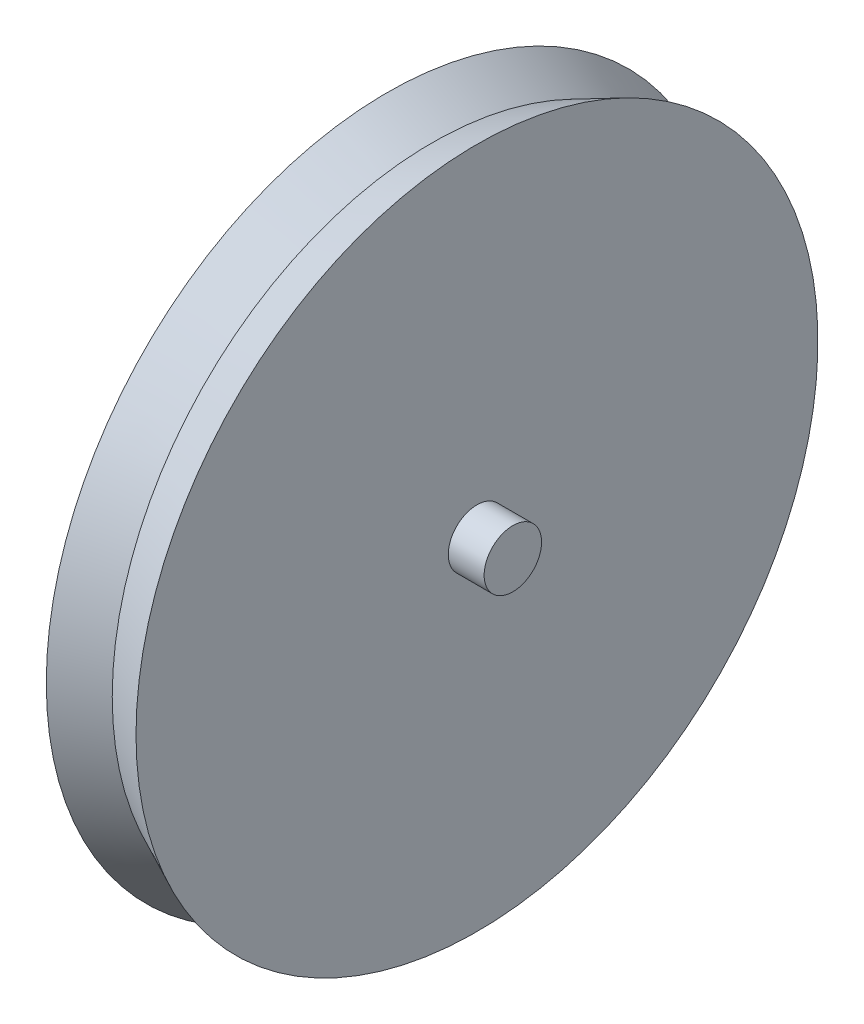
ISO-10303-21;
HEADER;
FILE_DESCRIPTION(('STEP AP214'),'2;1');
FILE_NAME('part.step','',(''),(''),'','','');
FILE_SCHEMA(('AUTOMOTIVE_DESIGN { 1 0 10303 214 1 1 1 1 }'));
ENDSEC;
DATA;
#1=APPLICATION_CONTEXT('core data for automotive mechanical design processes');
#2=APPLICATION_PROTOCOL_DEFINITION('international standard','automotive_design',2000,#1);
#3=PRODUCT_CONTEXT('',#1,'mechanical');
#4=PRODUCT('Part','Part','',(#3));
#5=PRODUCT_RELATED_PRODUCT_CATEGORY('part','',(#4));
#6=PRODUCT_DEFINITION_FORMATION('','',#4);
#7=PRODUCT_DEFINITION_CONTEXT('part definition',#1,'design');
#8=PRODUCT_DEFINITION('design','',#6,#7);
#9=PRODUCT_DEFINITION_SHAPE('','',#8);
#10=(LENGTH_UNIT() NAMED_UNIT(*) SI_UNIT(.MILLI.,.METRE.));
#11=(NAMED_UNIT(*) PLANE_ANGLE_UNIT() SI_UNIT($,.RADIAN.));
#12=(NAMED_UNIT(*) SI_UNIT($,.STERADIAN.) SOLID_ANGLE_UNIT());
#13=UNCERTAINTY_MEASURE_WITH_UNIT(LENGTH_MEASURE(1.E-05),#10,'distance_accuracy_value','');
#14=(GEOMETRIC_REPRESENTATION_CONTEXT(3) GLOBAL_UNCERTAINTY_ASSIGNED_CONTEXT((#13)) GLOBAL_UNIT_ASSIGNED_CONTEXT((#10,
#11,#12)) REPRESENTATION_CONTEXT('',''));
#15=CARTESIAN_POINT('',(0.,0.,0.));
#16=DIRECTION('',(0.,0.,1.));
#17=DIRECTION('',(1.,0.,0.));
#18=AXIS2_PLACEMENT_3D('',#15,#16,#17);
#19=CARTESIAN_POINT('',(0.,0.,0.));
#20=DIRECTION('',(1.,0.,0.));
#21=DIRECTION('',(0.,0.,-1.));
#22=AXIS2_PLACEMENT_3D('',#19,#20,#21);
#23=PLANE('',#22);
#24=CARTESIAN_POINT('',(0.,0.,0.));
#25=DIRECTION('',(1.,0.,0.));
#26=DIRECTION('',(0.,0.,-1.));
#27=AXIS2_PLACEMENT_3D('',#24,#25,#26);
#28=CIRCLE('',#27,1.27);
#29=CARTESIAN_POINT('',(0.,0.,-1.27));
#30=VERTEX_POINT('',#29);
#31=EDGE_CURVE('E51',#30,#30,#28,.T.);
#32=ORIENTED_EDGE('',*,*,#31,.T.);
#33=EDGE_LOOP('',(#32));
#34=FACE_BOUND('',#33,.T.);
#35=CARTESIAN_POINT('',(0.,0.,0.));
#36=DIRECTION('',(-1.,0.,0.));
#37=DIRECTION('',(0.,0.,1.));
#38=AXIS2_PLACEMENT_3D('',#35,#36,#37);
#39=CIRCLE('',#38,15.08125);
#40=CARTESIAN_POINT('',(0.,0.,15.08125));
#41=VERTEX_POINT('',#40);
#42=EDGE_CURVE('E46',#41,#41,#39,.T.);
#43=ORIENTED_EDGE('',*,*,#42,.T.);
#44=EDGE_LOOP('',(#43));
#45=FACE_BOUND('',#44,.T.);
#46=ADVANCED_FACE('F35',(#34,#45),#23,.F.);
#47=CARTESIAN_POINT('',(3.96875,0.,0.));
#48=DIRECTION('',(-1.,0.,0.));
#49=DIRECTION('',(0.,0.,1.));
#50=AXIS2_PLACEMENT_3D('',#47,#48,#49);
#51=PLANE('',#50);
#52=CARTESIAN_POINT('',(3.96875,0.,0.));
#53=DIRECTION('',(-1.,0.,0.));
#54=DIRECTION('',(0.,0.,1.));
#55=AXIS2_PLACEMENT_3D('',#52,#53,#54);
#56=CIRCLE('',#55,1.27);
#57=CARTESIAN_POINT('',(3.96875,0.,1.27));
#58=VERTEX_POINT('',#57);
#59=EDGE_CURVE('E38',#58,#58,#56,.T.);
#60=ORIENTED_EDGE('',*,*,#59,.T.);
#61=EDGE_LOOP('',(#60));
#62=FACE_BOUND('',#61,.T.);
#63=CARTESIAN_POINT('',(3.96875,0.,0.));
#64=DIRECTION('',(-1.,0.,0.));
#65=DIRECTION('',(0.,0.,1.));
#66=AXIS2_PLACEMENT_3D('',#63,#64,#65);
#67=CIRCLE('',#66,15.08125);
#68=CARTESIAN_POINT('',(3.96875,0.,15.08125));
#69=VERTEX_POINT('',#68);
#70=EDGE_CURVE('E10',#69,#69,#67,.T.);
#71=ORIENTED_EDGE('',*,*,#70,.F.);
#72=EDGE_LOOP('',(#71));
#73=FACE_BOUND('',#72,.T.);
#74=ADVANCED_FACE('F71',(#62,#73),#51,.F.);
#75=CARTESIAN_POINT('',(1.984375,0.,0.));
#76=DIRECTION('',(1.,0.,0.));
#77=DIRECTION('',(0.,0.,-1.));
#78=AXIS2_PLACEMENT_3D('',#75,#76,#77);
#79=CONICAL_SURFACE('',#78,14.1483885827314,0.439445568474056);
#80=ORIENTED_EDGE('',*,*,#70,.T.);
#81=EDGE_LOOP('',(#80));
#82=FACE_BOUND('',#81,.T.);
#83=CARTESIAN_POINT('',(1.984375,0.,0.));
#84=DIRECTION('',(-1.,0.,0.));
#85=DIRECTION('',(0.,0.,1.));
#86=AXIS2_PLACEMENT_3D('',#83,#84,#85);
#87=CIRCLE('',#86,14.1483885827314);
#88=CARTESIAN_POINT('',(1.984375,0.,14.1483885827314));
#89=VERTEX_POINT('',#88);
#90=EDGE_CURVE('E42',#89,#89,#87,.T.);
#91=ORIENTED_EDGE('',*,*,#90,.F.);
#92=EDGE_LOOP('',(#91));
#93=FACE_BOUND('',#92,.T.);
#94=ADVANCED_FACE('F74',(#82,#93),#79,.T.);
#95=CARTESIAN_POINT('',(0.,0.,0.));
#96=DIRECTION('',(-1.,0.,0.));
#97=DIRECTION('',(0.,0.,1.));
#98=AXIS2_PLACEMENT_3D('',#95,#96,#97);
#99=CONICAL_SURFACE('',#98,15.08125,0.439445568474056);
#100=ORIENTED_EDGE('',*,*,#90,.T.);
#101=EDGE_LOOP('',(#100));
#102=FACE_BOUND('',#101,.T.);
#103=ORIENTED_EDGE('',*,*,#42,.F.);
#104=EDGE_LOOP('',(#103));
#105=FACE_BOUND('',#104,.T.);
#106=ADVANCED_FACE('F79',(#102,#105),#99,.T.);
#107=CARTESIAN_POINT('',(5.55625,0.,0.));
#108=DIRECTION('',(1.,0.,0.));
#109=DIRECTION('',(0.,0.,-1.));
#110=AXIS2_PLACEMENT_3D('',#107,#108,#109);
#111=PLANE('',#110);
#112=CARTESIAN_POINT('',(5.55625,0.,0.));
#113=DIRECTION('',(1.,0.,0.));
#114=DIRECTION('',(0.,0.,-1.));
#115=AXIS2_PLACEMENT_3D('',#112,#113,#114);
#116=CIRCLE('',#115,1.27);
#117=CARTESIAN_POINT('',(5.55625,0.,-1.27));
#118=VERTEX_POINT('',#117);
#119=EDGE_CURVE('E57',#118,#118,#116,.T.);
#120=ORIENTED_EDGE('',*,*,#119,.T.);
#121=EDGE_LOOP('',(#120));
#122=FACE_BOUND('',#121,.T.);
#123=ADVANCED_FACE('F61',(#122),#111,.T.);
#124=CARTESIAN_POINT('',(-1.5875,0.,0.));
#125=DIRECTION('',(1.,0.,0.));
#126=DIRECTION('',(0.,0.,-1.));
#127=AXIS2_PLACEMENT_3D('',#124,#125,#126);
#128=CYLINDRICAL_SURFACE('',#127,1.27);
#129=ORIENTED_EDGE('',*,*,#119,.F.);
#130=EDGE_LOOP('',(#129));
#131=FACE_BOUND('',#130,.T.);
#132=ORIENTED_EDGE('',*,*,#59,.F.);
#133=EDGE_LOOP('',(#132));
#134=FACE_BOUND('',#133,.T.);
#135=ADVANCED_FACE('F63',(#131,#134),#128,.T.);
#136=CARTESIAN_POINT('',(-1.5875,0.,0.));
#137=DIRECTION('',(1.,0.,0.));
#138=DIRECTION('',(0.,0.,-1.));
#139=AXIS2_PLACEMENT_3D('',#136,#137,#138);
#140=CIRCLE('',#139,1.27);
#141=CARTESIAN_POINT('',(-1.5875,0.,-1.27));
#142=VERTEX_POINT('',#141);
#143=EDGE_CURVE('E54',#142,#142,#140,.T.);
#144=ORIENTED_EDGE('',*,*,#143,.T.);
#145=EDGE_LOOP('',(#144));
#146=FACE_BOUND('',#145,.T.);
#147=ORIENTED_EDGE('',*,*,#31,.F.);
#148=EDGE_LOOP('',(#147));
#149=FACE_BOUND('',#148,.T.);
#150=ADVANCED_FACE('F66',(#146,#149),#128,.T.);
#151=CARTESIAN_POINT('',(-1.5875,0.,0.));
#152=DIRECTION('',(1.,0.,0.));
#153=DIRECTION('',(0.,0.,-1.));
#154=AXIS2_PLACEMENT_3D('',#151,#152,#153);
#155=PLANE('',#154);
#156=ORIENTED_EDGE('',*,*,#143,.F.);
#157=EDGE_LOOP('',(#156));
#158=FACE_BOUND('',#157,.T.);
#159=ADVANCED_FACE('F87',(#158),#155,.F.);
#160=CLOSED_SHELL('',(#46,#74,#94,#106,#123,#135,#150,#159));
#161=MANIFOLD_SOLID_BREP('B2',#160);
#162=ADVANCED_BREP_SHAPE_REPRESENTATION('',(#18,#161),#14);
#163=SHAPE_DEFINITION_REPRESENTATION(#9,#162);
ENDSEC;
END-ISO-10303-21;
